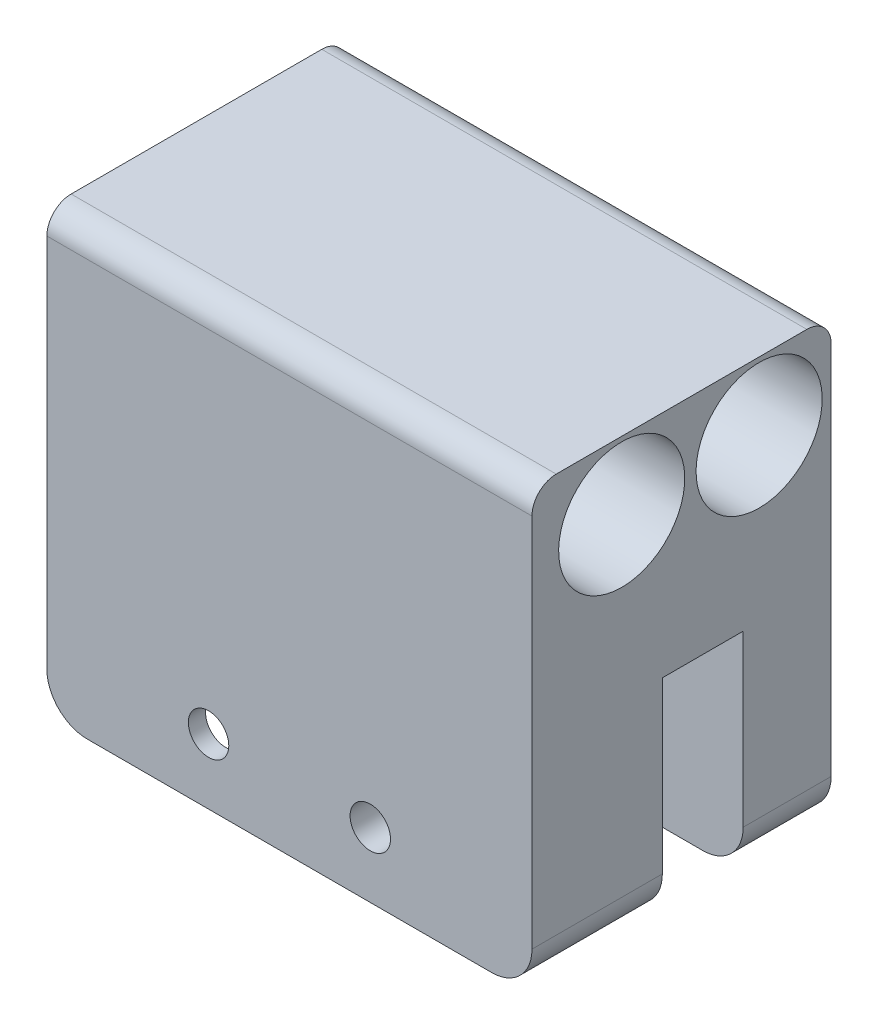
ISO-10303-21;
HEADER;
FILE_DESCRIPTION(('STEP AP214'),'2;1');
FILE_NAME('part.step','',(''),(''),'','','');
FILE_SCHEMA(('AUTOMOTIVE_DESIGN { 1 0 10303 214 1 1 1 1 }'));
ENDSEC;
DATA;
#1=APPLICATION_CONTEXT('core data for automotive mechanical design processes');
#2=APPLICATION_PROTOCOL_DEFINITION('international standard','automotive_design',2000,#1);
#3=PRODUCT_CONTEXT('',#1,'mechanical');
#4=PRODUCT('Part','Part','',(#3));
#5=PRODUCT_RELATED_PRODUCT_CATEGORY('part','',(#4));
#6=PRODUCT_DEFINITION_FORMATION('','',#4);
#7=PRODUCT_DEFINITION_CONTEXT('part definition',#1,'design');
#8=PRODUCT_DEFINITION('design','',#6,#7);
#9=PRODUCT_DEFINITION_SHAPE('','',#8);
#10=(LENGTH_UNIT() NAMED_UNIT(*) SI_UNIT(.MILLI.,.METRE.));
#11=(NAMED_UNIT(*) PLANE_ANGLE_UNIT() SI_UNIT($,.RADIAN.));
#12=(NAMED_UNIT(*) SI_UNIT($,.STERADIAN.) SOLID_ANGLE_UNIT());
#13=UNCERTAINTY_MEASURE_WITH_UNIT(LENGTH_MEASURE(1.E-05),#10,'distance_accuracy_value','');
#14=(GEOMETRIC_REPRESENTATION_CONTEXT(3) GLOBAL_UNCERTAINTY_ASSIGNED_CONTEXT((#13)) GLOBAL_UNIT_ASSIGNED_CONTEXT((#10,
#11,#12)) REPRESENTATION_CONTEXT('',''));
#15=CARTESIAN_POINT('',(0.,0.,0.));
#16=DIRECTION('',(0.,0.,1.));
#17=DIRECTION('',(1.,0.,0.));
#18=AXIS2_PLACEMENT_3D('',#15,#16,#17);
#19=CARTESIAN_POINT('',(-250.000000000002,198.300809789814,40.));
#20=DIRECTION('',(1.,0.,0.));
#21=DIRECTION('',(0.,0.,-1.));
#22=AXIS2_PLACEMENT_3D('',#19,#20,#21);
#23=PLANE('',#22);
#24=DIRECTION('',(0.,0.,1.));
#25=VECTOR('',#24,1.);
#26=CARTESIAN_POINT('',(-250.000000000002,194.212207188512,27.8748607563625));
#27=LINE('',#26,#25);
#28=CARTESIAN_POINT('',(-250.000000000002,194.212207188512,27.8748607563625));
#29=VERTEX_POINT('',#28);
#30=CARTESIAN_POINT('',(-250.000000000002,194.212207188512,37.8748607563625));
#31=VERTEX_POINT('',#30);
#32=EDGE_CURVE('E211',#29,#31,#27,.T.);
#33=ORIENTED_EDGE('',*,*,#32,.T.);
#34=DIRECTION('',(0.,-1.,0.));
#35=VECTOR('',#34,1.);
#36=CARTESIAN_POINT('',(-250.000000000002,184.212207188512,37.8748607563625));
#37=LINE('',#36,#35);
#38=CARTESIAN_POINT('',(-250.000000000002,173.212189340529,37.8748607563625));
#39=VERTEX_POINT('',#38);
#40=EDGE_CURVE('E214',#31,#39,#37,.T.);
#41=ORIENTED_EDGE('',*,*,#40,.T.);
#42=DIRECTION('',(0.,0.,-1.));
#43=VECTOR('',#42,1.);
#44=CARTESIAN_POINT('',(-250.000000000002,173.212189340529,40.));
#45=LINE('',#44,#43);
#46=CARTESIAN_POINT('',(-250.000000000002,173.212189340529,40.));
#47=VERTEX_POINT('',#46);
#48=EDGE_CURVE('E363',#47,#39,#45,.T.);
#49=ORIENTED_EDGE('',*,*,#48,.F.);
#50=DIRECTION('',(0.,1.,0.));
#51=VECTOR('',#50,1.);
#52=CARTESIAN_POINT('',(-250.000000000002,198.300809789814,40.));
#53=LINE('',#52,#51);
#54=CARTESIAN_POINT('',(-250.000000000002,219.601892068504,40.));
#55=VERTEX_POINT('',#54);
#56=EDGE_CURVE('E347',#47,#55,#53,.T.);
#57=ORIENTED_EDGE('',*,*,#56,.T.);
#58=CARTESIAN_POINT('',(-250.000000000002,219.601892068504,37.));
#59=DIRECTION('',(-1.,0.,0.));
#60=DIRECTION('',(0.,0.,-1.));
#61=AXIS2_PLACEMENT_3D('',#58,#59,#60);
#62=CIRCLE('',#61,3.);
#63=CARTESIAN_POINT('',(-250.000000000002,222.601892068504,37.));
#64=VERTEX_POINT('',#63);
#65=EDGE_CURVE('E378',#64,#55,#62,.F.);
#66=ORIENTED_EDGE('',*,*,#65,.F.);
#67=DIRECTION('',(0.,0.,-1.));
#68=VECTOR('',#67,1.);
#69=CARTESIAN_POINT('',(-250.000000000002,222.601892068504,40.));
#70=LINE('',#69,#68);
#71=CARTESIAN_POINT('',(-250.000000000002,222.601892068504,6.00000000000001));
#72=VERTEX_POINT('',#71);
#73=EDGE_CURVE('E359',#64,#72,#70,.T.);
#74=ORIENTED_EDGE('',*,*,#73,.T.);
#75=CARTESIAN_POINT('',(-250.000000000002,219.601892068504,6.));
#76=DIRECTION('',(-1.,0.,0.));
#77=DIRECTION('',(0.,0.,-1.));
#78=AXIS2_PLACEMENT_3D('',#75,#76,#77);
#79=CIRCLE('',#78,3.);
#80=CARTESIAN_POINT('',(-250.000000000002,219.601892068504,3.));
#81=VERTEX_POINT('',#80);
#82=EDGE_CURVE('E381',#81,#72,#79,.F.);
#83=ORIENTED_EDGE('',*,*,#82,.F.);
#84=DIRECTION('',(0.,-1.,0.));
#85=VECTOR('',#84,1.);
#86=CARTESIAN_POINT('',(-250.000000000002,222.601892068504,3.));
#87=LINE('',#86,#85);
#88=CARTESIAN_POINT('',(-250.000000000002,173.212189340529,3.));
#89=VERTEX_POINT('',#88);
#90=EDGE_CURVE('E320',#81,#89,#87,.T.);
#91=ORIENTED_EDGE('',*,*,#90,.T.);
#92=CARTESIAN_POINT('',(-250.000000000002,173.212189340529,13.8748607563626));
#93=VERTEX_POINT('',#92);
#94=EDGE_CURVE('E362',#93,#89,#45,.T.);
#95=ORIENTED_EDGE('',*,*,#94,.F.);
#96=DIRECTION('',(0.,1.,0.));
#97=VECTOR('',#96,1.);
#98=CARTESIAN_POINT('',(-250.000000000002,194.212207188512,13.8748607563625));
#99=LINE('',#98,#97);
#100=CARTESIAN_POINT('',(-250.000000000002,194.212207188512,13.8748607563625));
#101=VERTEX_POINT('',#100);
#102=EDGE_CURVE('E287',#93,#101,#99,.T.);
#103=ORIENTED_EDGE('',*,*,#102,.T.);
#104=DIRECTION('',(0.,0.,1.));
#105=VECTOR('',#104,1.);
#106=CARTESIAN_POINT('',(-250.000000000002,194.212207188512,13.8748607563625));
#107=LINE('',#106,#105);
#108=CARTESIAN_POINT('',(-250.000000000002,194.212207188512,23.8748607563625));
#109=VERTEX_POINT('',#108);
#110=EDGE_CURVE('E282',#101,#109,#107,.T.);
#111=ORIENTED_EDGE('',*,*,#110,.T.);
#112=DIRECTION('',(0.,-1.,0.));
#113=VECTOR('',#112,1.);
#114=CARTESIAN_POINT('',(-250.000000000002,184.212207188512,23.8748607563625));
#115=LINE('',#114,#113);
#116=CARTESIAN_POINT('',(-250.000000000002,173.212189340529,23.8748607563625));
#117=VERTEX_POINT('',#116);
#118=EDGE_CURVE('E292',#109,#117,#115,.T.);
#119=ORIENTED_EDGE('',*,*,#118,.T.);
#120=CARTESIAN_POINT('',(-250.000000000002,173.212189340529,27.8748607563626));
#121=VERTEX_POINT('',#120);
#122=EDGE_CURVE('E367',#121,#117,#45,.T.);
#123=ORIENTED_EDGE('',*,*,#122,.F.);
#124=DIRECTION('',(0.,1.,0.));
#125=VECTOR('',#124,1.);
#126=CARTESIAN_POINT('',(-250.000000000002,184.212207188512,27.8748607563625));
#127=LINE('',#126,#125);
#128=EDGE_CURVE('E224',#121,#29,#127,.T.);
#129=ORIENTED_EDGE('',*,*,#128,.T.);
#130=EDGE_LOOP('',(#33,#41,#49,#57,#66,#74,#83,#91,#95,#103,#111,#119,#123,#129));
#131=FACE_BOUND('',#130,.T.);
#132=CARTESIAN_POINT('',(-250.000000000002,214.212207188512,11.9024120802236));
#133=DIRECTION('',(-1.,0.,0.));
#134=DIRECTION('',(0.,-1.,0.));
#135=AXIS2_PLACEMENT_3D('',#132,#133,#134);
#136=CIRCLE('',#135,7.79999999999996);
#137=CARTESIAN_POINT('',(-250.000000000002,206.412207188512,11.9024120802236));
#138=VERTEX_POINT('',#137);
#139=EDGE_CURVE('E327',#138,#138,#136,.T.);
#140=ORIENTED_EDGE('',*,*,#139,.F.);
#141=EDGE_LOOP('',(#140));
#142=FACE_BOUND('',#141,.T.);
#143=CARTESIAN_POINT('',(-250.000000000002,214.212207188512,28.9024120802236));
#144=DIRECTION('',(-1.,0.,0.));
#145=DIRECTION('',(0.,-1.,0.));
#146=AXIS2_PLACEMENT_3D('',#143,#144,#145);
#147=CIRCLE('',#146,7.79999999999994);
#148=CARTESIAN_POINT('',(-250.000000000002,206.412207188512,28.9024120802236));
#149=VERTEX_POINT('',#148);
#150=EDGE_CURVE('E334',#149,#149,#147,.T.);
#151=ORIENTED_EDGE('',*,*,#150,.F.);
#152=EDGE_LOOP('',(#151));
#153=FACE_BOUND('',#152,.T.);
#154=DIRECTION('',(0.,-1.,0.));
#155=VECTOR('',#154,1.);
#156=CARTESIAN_POINT('',(-250.000000000002,200.712207188564,15.7200000000164));
#157=LINE('',#156,#155);
#158=CARTESIAN_POINT('',(-250.000000000002,205.712207188564,15.7200000000164));
#159=VERTEX_POINT('',#158);
#160=CARTESIAN_POINT('',(-250.000000000002,200.712207188564,15.7200000000164));
#161=VERTEX_POINT('',#160);
#162=EDGE_CURVE('E210',#159,#161,#157,.T.);
#163=ORIENTED_EDGE('',*,*,#162,.F.);
#164=DIRECTION('',(0.,0.,-1.));
#165=VECTOR('',#164,1.);
#166=CARTESIAN_POINT('',(-250.000000000002,205.712207188564,15.7200000000164));
#167=LINE('',#166,#165);
#168=CARTESIAN_POINT('',(-250.000000000002,205.712207188564,17.7200000000164));
#169=VERTEX_POINT('',#168);
#170=EDGE_CURVE('E207',#169,#159,#167,.T.);
#171=ORIENTED_EDGE('',*,*,#170,.F.);
#172=DIRECTION('',(0.,1.,0.));
#173=VECTOR('',#172,1.);
#174=CARTESIAN_POINT('',(-250.000000000002,200.712207188564,17.7200000000164));
#175=LINE('',#174,#173);
#176=CARTESIAN_POINT('',(-250.000000000002,200.712207188564,17.7200000000164));
#177=VERTEX_POINT('',#176);
#178=EDGE_CURVE('E55',#177,#169,#175,.T.);
#179=ORIENTED_EDGE('',*,*,#178,.F.);
#180=DIRECTION('',(0.,0.,1.));
#181=VECTOR('',#180,1.);
#182=CARTESIAN_POINT('',(-250.000000000002,200.712207188564,15.7200000000164));
#183=LINE('',#182,#181);
#184=EDGE_CURVE('E50',#161,#177,#183,.T.);
#185=ORIENTED_EDGE('',*,*,#184,.F.);
#186=EDGE_LOOP('',(#163,#171,#179,#185));
#187=FACE_BOUND('',#186,.T.);
#188=ADVANCED_FACE('F35',(#131,#142,#153,#187),#23,.F.);
#189=CARTESIAN_POINT('',(-245.000000000002,173.212189340529,40.));
#190=DIRECTION('',(0.,0.,-1.));
#191=DIRECTION('',(-1.,0.,0.));
#192=AXIS2_PLACEMENT_3D('',#189,#190,#191);
#193=CYLINDRICAL_SURFACE('',#192,5.);
#194=ORIENTED_EDGE('',*,*,#122,.T.);
#195=CARTESIAN_POINT('',(-245.000000000002,173.212189340529,23.8748607563625));
#196=DIRECTION('',(0.,0.,-1.));
#197=DIRECTION('',(1.,0.,0.));
#198=AXIS2_PLACEMENT_3D('',#195,#196,#197);
#199=CIRCLE('',#198,5.);
#200=CARTESIAN_POINT('',(-245.000000000002,168.212189340529,23.8748607563625));
#201=VERTEX_POINT('',#200);
#202=EDGE_CURVE('E298',#201,#117,#199,.T.);
#203=ORIENTED_EDGE('',*,*,#202,.F.);
#204=DIRECTION('',(0.,0.,-1.));
#205=VECTOR('',#204,1.);
#206=CARTESIAN_POINT('',(-245.000000000002,168.212189340529,40.));
#207=LINE('',#206,#205);
#208=CARTESIAN_POINT('',(-245.000000000002,168.212189340529,27.8748607563626));
#209=VERTEX_POINT('',#208);
#210=EDGE_CURVE('E372',#209,#201,#207,.T.);
#211=ORIENTED_EDGE('',*,*,#210,.F.);
#212=CARTESIAN_POINT('',(-245.000000000002,173.212189340529,27.8748607563626));
#213=DIRECTION('',(0.,0.,1.));
#214=DIRECTION('',(0.,-1.,0.));
#215=AXIS2_PLACEMENT_3D('',#212,#213,#214);
#216=CIRCLE('',#215,5.);
#217=EDGE_CURVE('E244',#121,#209,#216,.T.);
#218=ORIENTED_EDGE('',*,*,#217,.F.);
#219=EDGE_LOOP('',(#194,#203,#211,#218));
#220=FACE_BOUND('',#219,.T.);
#221=ADVANCED_FACE('F413',(#220),#193,.T.);
#222=CARTESIAN_POINT('',(-230.000000000002,176.251270746749,3.));
#223=DIRECTION('',(0.,0.,1.));
#224=DIRECTION('',(1.,0.,0.));
#225=AXIS2_PLACEMENT_3D('',#222,#223,#224);
#226=CYLINDRICAL_SURFACE('',#225,2.5);
#227=CARTESIAN_POINT('',(-230.000000000002,176.251270746749,27.8748607563625));
#228=DIRECTION('',(0.,0.,1.));
#229=DIRECTION('',(0.,-1.,0.));
#230=AXIS2_PLACEMENT_3D('',#227,#228,#229);
#231=CIRCLE('',#230,2.5);
#232=CARTESIAN_POINT('',(-230.000000000002,173.751270746749,27.8748607563626));
#233=VERTEX_POINT('',#232);
#234=EDGE_CURVE('E243',#233,#233,#231,.F.);
#235=ORIENTED_EDGE('',*,*,#234,.F.);
#236=EDGE_LOOP('',(#235));
#237=FACE_BOUND('',#236,.T.);
#238=CARTESIAN_POINT('',(-230.000000000002,176.251270746749,23.8748607563625));
#239=DIRECTION('',(0.,0.,-1.));
#240=DIRECTION('',(1.,0.,0.));
#241=AXIS2_PLACEMENT_3D('',#238,#239,#240);
#242=CIRCLE('',#241,2.5);
#243=CARTESIAN_POINT('',(-227.500000000002,176.251270746749,23.8748607563625));
#244=VERTEX_POINT('',#243);
#245=EDGE_CURVE('E266',#244,#244,#242,.T.);
#246=ORIENTED_EDGE('',*,*,#245,.T.);
#247=EDGE_LOOP('',(#246));
#248=FACE_BOUND('',#247,.T.);
#249=ADVANCED_FACE('F409',(#237,#248),#226,.F.);
#250=CARTESIAN_POINT('',(-195.000000000002,173.212189340529,40.));
#251=DIRECTION('',(0.,0.,-1.));
#252=DIRECTION('',(-1.,0.,0.));
#253=AXIS2_PLACEMENT_3D('',#250,#251,#252);
#254=CYLINDRICAL_SURFACE('',#253,5.);
#255=DIRECTION('',(0.,0.,-1.));
#256=VECTOR('',#255,1.);
#257=CARTESIAN_POINT('',(-195.000000000002,168.212189340529,40.));
#258=LINE('',#257,#256);
#259=CARTESIAN_POINT('',(-195.000000000002,168.212189340529,13.8748607563626));
#260=VERTEX_POINT('',#259);
#261=CARTESIAN_POINT('',(-195.000000000002,168.212189340529,3.));
#262=VERTEX_POINT('',#261);
#263=EDGE_CURVE('E371',#260,#262,#258,.T.);
#264=ORIENTED_EDGE('',*,*,#263,.T.);
#265=CARTESIAN_POINT('',(-195.000000000002,173.212189340529,3.));
#266=DIRECTION('',(0.,0.,1.));
#267=DIRECTION('',(-1.,0.,0.));
#268=AXIS2_PLACEMENT_3D('',#265,#266,#267);
#269=CIRCLE('',#268,5.);
#270=CARTESIAN_POINT('',(-190.000000000002,173.212189340529,3.00000000000002));
#271=VERTEX_POINT('',#270);
#272=EDGE_CURVE('E314',#262,#271,#269,.T.);
#273=ORIENTED_EDGE('',*,*,#272,.T.);
#274=DIRECTION('',(0.,0.,-1.));
#275=VECTOR('',#274,1.);
#276=CARTESIAN_POINT('',(-190.000000000002,173.212189340529,40.));
#277=LINE('',#276,#275);
#278=CARTESIAN_POINT('',(-190.000000000002,173.212189340529,13.8748607563625));
#279=VERTEX_POINT('',#278);
#280=EDGE_CURVE('E352',#279,#271,#277,.T.);
#281=ORIENTED_EDGE('',*,*,#280,.F.);
#282=CARTESIAN_POINT('',(-195.000000000002,173.212189340529,13.8748607563626));
#283=DIRECTION('',(0.,0.,1.));
#284=DIRECTION('',(0.,-1.,0.));
#285=AXIS2_PLACEMENT_3D('',#282,#283,#284);
#286=CIRCLE('',#285,5.);
#287=EDGE_CURVE('E311',#260,#279,#286,.T.);
#288=ORIENTED_EDGE('',*,*,#287,.F.);
#289=EDGE_LOOP('',(#264,#273,#281,#288));
#290=FACE_BOUND('',#289,.T.);
#291=ADVANCED_FACE('F412',(#290),#254,.T.);
#292=CARTESIAN_POINT('',(-245.000000000002,168.212189340529,40.));
#293=DIRECTION('',(0.,1.,0.));
#294=DIRECTION('',(0.,0.,-1.));
#295=AXIS2_PLACEMENT_3D('',#292,#293,#294);
#296=PLANE('',#295);
#297=CARTESIAN_POINT('',(-199.500000000002,168.212189340529,8.5));
#298=DIRECTION('',(0.,1.,0.));
#299=DIRECTION('',(0.,0.,1.));
#300=AXIS2_PLACEMENT_3D('',#297,#298,#299);
#301=CIRCLE('',#300,4.25000000000001);
#302=CARTESIAN_POINT('',(-199.500000000002,168.212189340529,12.75));
#303=VERTEX_POINT('',#302);
#304=EDGE_CURVE('E255',#303,#303,#301,.T.);
#305=ORIENTED_EDGE('',*,*,#304,.T.);
#306=EDGE_LOOP('',(#305));
#307=FACE_BOUND('',#306,.T.);
#308=CARTESIAN_POINT('',(-240.500000000002,168.212189340529,8.50000000000003));
#309=DIRECTION('',(0.,1.,0.));
#310=DIRECTION('',(0.,0.,-1.));
#311=AXIS2_PLACEMENT_3D('',#308,#309,#310);
#312=CIRCLE('',#311,4.25);
#313=CARTESIAN_POINT('',(-240.500000000002,168.212189340529,4.25000000000003));
#314=VERTEX_POINT('',#313);
#315=EDGE_CURVE('E250',#314,#314,#312,.T.);
#316=ORIENTED_EDGE('',*,*,#315,.T.);
#317=EDGE_LOOP('',(#316));
#318=FACE_BOUND('',#317,.T.);
#319=CARTESIAN_POINT('',(-245.000000000002,168.212189340529,13.8748607563626));
#320=VERTEX_POINT('',#319);
#321=CARTESIAN_POINT('',(-245.000000000002,168.212189340529,3.));
#322=VERTEX_POINT('',#321);
#323=EDGE_CURVE('E366',#320,#322,#207,.T.);
#324=ORIENTED_EDGE('',*,*,#323,.T.);
#325=DIRECTION('',(1.,0.,0.));
#326=VECTOR('',#325,1.);
#327=CARTESIAN_POINT('',(-245.000000000002,168.212189340529,3.));
#328=LINE('',#327,#326);
#329=EDGE_CURVE('E324',#322,#262,#328,.T.);
#330=ORIENTED_EDGE('',*,*,#329,.T.);
#331=ORIENTED_EDGE('',*,*,#263,.F.);
#332=DIRECTION('',(1.,0.,0.));
#333=VECTOR('',#332,1.);
#334=CARTESIAN_POINT('',(-245.000000000002,168.212189340529,13.8748607563626));
#335=LINE('',#334,#333);
#336=EDGE_CURVE('E309',#320,#260,#335,.T.);
#337=ORIENTED_EDGE('',*,*,#336,.F.);
#338=EDGE_LOOP('',(#324,#330,#331,#337));
#339=FACE_BOUND('',#338,.T.);
#340=ADVANCED_FACE('F473',(#307,#318,#339),#296,.F.);
#341=ORIENTED_EDGE('',*,*,#94,.T.);
#342=CARTESIAN_POINT('',(-245.000000000002,173.212189340529,3.));
#343=DIRECTION('',(0.,0.,1.));
#344=DIRECTION('',(-1.,0.,0.));
#345=AXIS2_PLACEMENT_3D('',#342,#343,#344);
#346=CIRCLE('',#345,5.);
#347=EDGE_CURVE('E322',#89,#322,#346,.T.);
#348=ORIENTED_EDGE('',*,*,#347,.T.);
#349=ORIENTED_EDGE('',*,*,#323,.F.);
#350=CARTESIAN_POINT('',(-245.000000000002,173.212189340529,13.8748607563626));
#351=DIRECTION('',(0.,0.,1.));
#352=DIRECTION('',(0.,-1.,0.));
#353=AXIS2_PLACEMENT_3D('',#350,#351,#352);
#354=CIRCLE('',#353,5.);
#355=EDGE_CURVE('E307',#93,#320,#354,.T.);
#356=ORIENTED_EDGE('',*,*,#355,.F.);
#357=EDGE_LOOP('',(#341,#348,#349,#356));
#358=FACE_BOUND('',#357,.T.);
#359=ADVANCED_FACE('F458',(#358),#193,.T.);
#360=CARTESIAN_POINT('',(-190.000000000002,173.212189340529,40.));
#361=VERTEX_POINT('',#360);
#362=CARTESIAN_POINT('',(-190.000000000002,173.212189340529,23.8748607563625));
#363=VERTEX_POINT('',#362);
#364=EDGE_CURVE('E353',#361,#363,#277,.T.);
#365=ORIENTED_EDGE('',*,*,#364,.F.);
#366=CARTESIAN_POINT('',(-195.000000000002,173.212189340529,40.));
#367=DIRECTION('',(0.,0.,-1.));
#368=DIRECTION('',(-1.,0.,0.));
#369=AXIS2_PLACEMENT_3D('',#366,#367,#368);
#370=CIRCLE('',#369,5.);
#371=CARTESIAN_POINT('',(-195.000000000002,168.212189340529,40.));
#372=VERTEX_POINT('',#371);
#373=EDGE_CURVE('E330',#361,#372,#370,.T.);
#374=ORIENTED_EDGE('',*,*,#373,.T.);
#375=CARTESIAN_POINT('',(-195.000000000002,168.212189340529,23.8748607563625));
#376=VERTEX_POINT('',#375);
#377=EDGE_CURVE('E373',#372,#376,#258,.T.);
#378=ORIENTED_EDGE('',*,*,#377,.T.);
#379=CARTESIAN_POINT('',(-195.000000000002,173.212189340529,23.8748607563625));
#380=DIRECTION('',(0.,0.,-1.));
#381=DIRECTION('',(1.,0.,0.));
#382=AXIS2_PLACEMENT_3D('',#379,#380,#381);
#383=CIRCLE('',#382,5.);
#384=EDGE_CURVE('E304',#363,#376,#383,.T.);
#385=ORIENTED_EDGE('',*,*,#384,.F.);
#386=EDGE_LOOP('',(#365,#374,#378,#385));
#387=FACE_BOUND('',#386,.T.);
#388=ADVANCED_FACE('F433',(#387),#254,.T.);
#389=ORIENTED_EDGE('',*,*,#210,.T.);
#390=DIRECTION('',(-1.,0.,0.));
#391=VECTOR('',#390,1.);
#392=CARTESIAN_POINT('',(-245.000000000002,168.212189340529,23.8748607563625));
#393=LINE('',#392,#391);
#394=EDGE_CURVE('E302',#376,#201,#393,.T.);
#395=ORIENTED_EDGE('',*,*,#394,.F.);
#396=ORIENTED_EDGE('',*,*,#377,.F.);
#397=DIRECTION('',(-1.,0.,0.));
#398=VECTOR('',#397,1.);
#399=CARTESIAN_POINT('',(-245.000000000002,168.212189340529,40.));
#400=LINE('',#399,#398);
#401=CARTESIAN_POINT('',(-245.000000000002,168.212189340529,40.));
#402=VERTEX_POINT('',#401);
#403=EDGE_CURVE('E341',#372,#402,#400,.T.);
#404=ORIENTED_EDGE('',*,*,#403,.T.);
#405=CARTESIAN_POINT('',(-245.000000000002,168.212189340529,37.8748607563625));
#406=VERTEX_POINT('',#405);
#407=EDGE_CURVE('E368',#402,#406,#207,.T.);
#408=ORIENTED_EDGE('',*,*,#407,.T.);
#409=DIRECTION('',(-1.,0.,0.));
#410=VECTOR('',#409,1.);
#411=CARTESIAN_POINT('',(-245.000000000002,168.212189340529,37.8748607563625));
#412=LINE('',#411,#410);
#413=CARTESIAN_POINT('',(-220.000000000002,168.212189340529,37.8748607563626));
#414=VERTEX_POINT('',#413);
#415=EDGE_CURVE('E240',#414,#406,#412,.T.);
#416=ORIENTED_EDGE('',*,*,#415,.F.);
#417=DIRECTION('',(0.,0.,-1.));
#418=VECTOR('',#417,1.);
#419=CARTESIAN_POINT('',(-220.000000000002,168.212189340529,40.));
#420=LINE('',#419,#418);
#421=CARTESIAN_POINT('',(-220.000000000002,168.212189340529,27.8748607563625));
#422=VERTEX_POINT('',#421);
#423=EDGE_CURVE('E11',#414,#422,#420,.T.);
#424=ORIENTED_EDGE('',*,*,#423,.T.);
#425=DIRECTION('',(1.,0.,0.));
#426=VECTOR('',#425,1.);
#427=CARTESIAN_POINT('',(-245.000000000002,168.212189340529,27.8748607563626));
#428=LINE('',#427,#426);
#429=EDGE_CURVE('E247',#209,#422,#428,.T.);
#430=ORIENTED_EDGE('',*,*,#429,.F.);
#431=EDGE_LOOP('',(#389,#395,#396,#404,#408,#416,#424,#430));
#432=FACE_BOUND('',#431,.T.);
#433=ADVANCED_FACE('F446',(#432),#296,.F.);
#434=ORIENTED_EDGE('',*,*,#407,.F.);
#435=CARTESIAN_POINT('',(-245.000000000002,173.212189340529,40.));
#436=DIRECTION('',(0.,0.,-1.));
#437=DIRECTION('',(-1.,0.,0.));
#438=AXIS2_PLACEMENT_3D('',#435,#436,#437);
#439=CIRCLE('',#438,5.);
#440=EDGE_CURVE('E344',#402,#47,#439,.T.);
#441=ORIENTED_EDGE('',*,*,#440,.T.);
#442=ORIENTED_EDGE('',*,*,#48,.T.);
#443=CARTESIAN_POINT('',(-245.000000000002,173.212189340529,37.8748607563625));
#444=DIRECTION('',(0.,0.,-1.));
#445=DIRECTION('',(1.,0.,0.));
#446=AXIS2_PLACEMENT_3D('',#443,#444,#445);
#447=CIRCLE('',#446,5.);
#448=EDGE_CURVE('E237',#406,#39,#447,.T.);
#449=ORIENTED_EDGE('',*,*,#448,.F.);
#450=EDGE_LOOP('',(#434,#441,#442,#449));
#451=FACE_BOUND('',#450,.T.);
#452=ADVANCED_FACE('F496',(#451),#193,.T.);
#453=CARTESIAN_POINT('',(-194.03319899616,222.601892068504,40.));
#454=DIRECTION('',(0.,-1.,0.));
#455=DIRECTION('',(0.,0.,1.));
#456=AXIS2_PLACEMENT_3D('',#453,#454,#455);
#457=PLANE('',#456);
#458=ORIENTED_EDGE('',*,*,#73,.F.);
#459=DIRECTION('',(1.,0.,0.));
#460=VECTOR('',#459,1.);
#461=CARTESIAN_POINT('',(-194.03319899616,222.601892068504,37.));
#462=LINE('',#461,#460);
#463=CARTESIAN_POINT('',(-190.000000000002,222.601892068504,37.));
#464=VERTEX_POINT('',#463);
#465=EDGE_CURVE('E384',#464,#64,#462,.F.);
#466=ORIENTED_EDGE('',*,*,#465,.F.);
#467=DIRECTION('',(0.,0.,-1.));
#468=VECTOR('',#467,1.);
#469=CARTESIAN_POINT('',(-190.000000000002,222.601892068504,40.));
#470=LINE('',#469,#468);
#471=CARTESIAN_POINT('',(-190.000000000002,222.601892068504,6.00000000000001));
#472=VERTEX_POINT('',#471);
#473=EDGE_CURVE('E356',#464,#472,#470,.T.);
#474=ORIENTED_EDGE('',*,*,#473,.T.);
#475=DIRECTION('',(-1.,0.,0.));
#476=VECTOR('',#475,1.);
#477=CARTESIAN_POINT('',(-190.000000000002,222.601892068504,6.));
#478=LINE('',#477,#476);
#479=EDGE_CURVE('E386',#72,#472,#478,.F.);
#480=ORIENTED_EDGE('',*,*,#479,.F.);
#481=EDGE_LOOP('',(#458,#466,#474,#480));
#482=FACE_BOUND('',#481,.T.);
#483=ADVANCED_FACE('F498',(#482),#457,.F.);
#484=CARTESIAN_POINT('',(-190.000000000002,173.212189340529,40.));
#485=DIRECTION('',(-1.,0.,0.));
#486=DIRECTION('',(0.,1.,0.));
#487=AXIS2_PLACEMENT_3D('',#484,#485,#486);
#488=PLANE('',#487);
#489=CARTESIAN_POINT('',(-190.000000000002,214.212207188512,28.9024120802236));
#490=DIRECTION('',(-1.,0.,0.));
#491=DIRECTION('',(0.,-1.,0.));
#492=AXIS2_PLACEMENT_3D('',#489,#490,#491);
#493=CIRCLE('',#492,7.79999999999994);
#494=CARTESIAN_POINT('',(-190.000000000002,206.412207188512,28.9024120802236));
#495=VERTEX_POINT('',#494);
#496=EDGE_CURVE('E326',#495,#495,#493,.T.);
#497=ORIENTED_EDGE('',*,*,#496,.T.);
#498=EDGE_LOOP('',(#497));
#499=FACE_BOUND('',#498,.T.);
#500=CARTESIAN_POINT('',(-190.000000000002,214.212207188512,11.9024120802236));
#501=DIRECTION('',(-1.,0.,0.));
#502=DIRECTION('',(0.,-1.,0.));
#503=AXIS2_PLACEMENT_3D('',#500,#501,#502);
#504=CIRCLE('',#503,7.79999999999996);
#505=CARTESIAN_POINT('',(-190.000000000002,206.412207188512,11.9024120802236));
#506=VERTEX_POINT('',#505);
#507=EDGE_CURVE('E331',#506,#506,#504,.T.);
#508=ORIENTED_EDGE('',*,*,#507,.T.);
#509=EDGE_LOOP('',(#508));
#510=FACE_BOUND('',#509,.T.);
#511=ORIENTED_EDGE('',*,*,#280,.T.);
#512=DIRECTION('',(0.,1.,0.));
#513=VECTOR('',#512,1.);
#514=CARTESIAN_POINT('',(-190.000000000002,173.212189340529,3.));
#515=LINE('',#514,#513);
#516=CARTESIAN_POINT('',(-190.000000000002,219.601892068504,3.));
#517=VERTEX_POINT('',#516);
#518=EDGE_CURVE('E317',#271,#517,#515,.T.);
#519=ORIENTED_EDGE('',*,*,#518,.T.);
#520=CARTESIAN_POINT('',(-190.000000000002,219.601892068504,6.));
#521=DIRECTION('',(1.,0.,0.));
#522=DIRECTION('',(0.,1.,0.));
#523=AXIS2_PLACEMENT_3D('',#520,#521,#522);
#524=CIRCLE('',#523,3.);
#525=EDGE_CURVE('E391',#472,#517,#524,.F.);
#526=ORIENTED_EDGE('',*,*,#525,.F.);
#527=ORIENTED_EDGE('',*,*,#473,.F.);
#528=CARTESIAN_POINT('',(-190.000000000002,219.601892068504,37.));
#529=DIRECTION('',(1.,0.,0.));
#530=DIRECTION('',(0.,1.,0.));
#531=AXIS2_PLACEMENT_3D('',#528,#529,#530);
#532=CIRCLE('',#531,3.);
#533=CARTESIAN_POINT('',(-190.000000000002,219.601892068504,40.));
#534=VERTEX_POINT('',#533);
#535=EDGE_CURVE('E389',#534,#464,#532,.F.);
#536=ORIENTED_EDGE('',*,*,#535,.F.);
#537=DIRECTION('',(0.,-1.,0.));
#538=VECTOR('',#537,1.);
#539=CARTESIAN_POINT('',(-190.000000000002,222.601892068504,40.));
#540=LINE('',#539,#538);
#541=EDGE_CURVE('E350',#534,#361,#540,.T.);
#542=ORIENTED_EDGE('',*,*,#541,.T.);
#543=ORIENTED_EDGE('',*,*,#364,.T.);
#544=DIRECTION('',(0.,-1.,0.));
#545=VECTOR('',#544,1.);
#546=CARTESIAN_POINT('',(-190.000000000002,194.212207188512,23.8748607563625));
#547=LINE('',#546,#545);
#548=CARTESIAN_POINT('',(-190.000000000002,194.212207188512,23.8748607563625));
#549=VERTEX_POINT('',#548);
#550=EDGE_CURVE('E286',#549,#363,#547,.T.);
#551=ORIENTED_EDGE('',*,*,#550,.F.);
#552=DIRECTION('',(0.,0.,1.));
#553=VECTOR('',#552,1.);
#554=CARTESIAN_POINT('',(-190.000000000002,194.212207188512,13.8748607563625));
#555=LINE('',#554,#553);
#556=CARTESIAN_POINT('',(-190.000000000002,194.212207188512,13.8748607563625));
#557=VERTEX_POINT('',#556);
#558=EDGE_CURVE('E283',#557,#549,#555,.T.);
#559=ORIENTED_EDGE('',*,*,#558,.F.);
#560=DIRECTION('',(0.,1.,0.));
#561=VECTOR('',#560,1.);
#562=CARTESIAN_POINT('',(-190.000000000002,173.212189340529,13.8748607563626));
#563=LINE('',#562,#561);
#564=EDGE_CURVE('E43',#279,#557,#563,.T.);
#565=ORIENTED_EDGE('',*,*,#564,.F.);
#566=EDGE_LOOP('',(#511,#519,#526,#527,#536,#542,#543,#551,#559,#565));
#567=FACE_BOUND('',#566,.T.);
#568=ADVANCED_FACE('F436',(#499,#510,#567),#488,.F.);
#569=CARTESIAN_POINT('',(-195.000000000002,173.212189340529,40.));
#570=DIRECTION('',(0.,0.,-1.));
#571=DIRECTION('',(-1.,0.,0.));
#572=AXIS2_PLACEMENT_3D('',#569,#570,#571);
#573=PLANE('',#572);
#574=CARTESIAN_POINT('',(-210.000000000002,176.251270746749,40.));
#575=DIRECTION('',(0.,0.,-1.));
#576=DIRECTION('',(1.,0.,0.));
#577=AXIS2_PLACEMENT_3D('',#574,#575,#576);
#578=CIRCLE('',#577,2.5);
#579=CARTESIAN_POINT('',(-207.500000000002,176.251270746749,40.));
#580=VERTEX_POINT('',#579);
#581=EDGE_CURVE('E267',#580,#580,#578,.T.);
#582=ORIENTED_EDGE('',*,*,#581,.T.);
#583=EDGE_LOOP('',(#582));
#584=FACE_BOUND('',#583,.T.);
#585=CARTESIAN_POINT('',(-230.000000000002,176.251270746749,40.));
#586=DIRECTION('',(0.,0.,-1.));
#587=DIRECTION('',(1.,0.,0.));
#588=AXIS2_PLACEMENT_3D('',#585,#586,#587);
#589=CIRCLE('',#588,2.5);
#590=CARTESIAN_POINT('',(-227.500000000002,176.251270746749,40.));
#591=VERTEX_POINT('',#590);
#592=EDGE_CURVE('E254',#591,#591,#589,.T.);
#593=ORIENTED_EDGE('',*,*,#592,.T.);
#594=EDGE_LOOP('',(#593));
#595=FACE_BOUND('',#594,.T.);
#596=ORIENTED_EDGE('',*,*,#56,.F.);
#597=ORIENTED_EDGE('',*,*,#440,.F.);
#598=ORIENTED_EDGE('',*,*,#403,.F.);
#599=ORIENTED_EDGE('',*,*,#373,.F.);
#600=ORIENTED_EDGE('',*,*,#541,.F.);
#601=DIRECTION('',(1.,0.,0.));
#602=VECTOR('',#601,1.);
#603=CARTESIAN_POINT('',(-195.000000000002,219.601892068504,40.));
#604=LINE('',#603,#602);
#605=EDGE_CURVE('E394',#55,#534,#604,.T.);
#606=ORIENTED_EDGE('',*,*,#605,.F.);
#607=EDGE_LOOP('',(#596,#597,#598,#599,#600,#606));
#608=FACE_BOUND('',#607,.T.);
#609=ADVANCED_FACE('F442',(#584,#595,#608),#573,.F.);
#610=CARTESIAN_POINT('',(-250.000000000002,214.212207188512,28.9024120802236));
#611=DIRECTION('',(1.,0.,0.));
#612=DIRECTION('',(0.,-1.,0.));
#613=AXIS2_PLACEMENT_3D('',#610,#611,#612);
#614=CYLINDRICAL_SURFACE('',#613,7.79999999999994);
#615=ORIENTED_EDGE('',*,*,#150,.T.);
#616=EDGE_LOOP('',(#615));
#617=FACE_BOUND('',#616,.T.);
#618=ORIENTED_EDGE('',*,*,#496,.F.);
#619=EDGE_LOOP('',(#618));
#620=FACE_BOUND('',#619,.T.);
#621=ADVANCED_FACE('F735',(#617,#620),#614,.F.);
#622=CARTESIAN_POINT('',(-250.000000000002,214.212207188512,11.9024120802236));
#623=DIRECTION('',(1.,0.,0.));
#624=DIRECTION('',(0.,-1.,0.));
#625=AXIS2_PLACEMENT_3D('',#622,#623,#624);
#626=CYLINDRICAL_SURFACE('',#625,7.79999999999996);
#627=ORIENTED_EDGE('',*,*,#139,.T.);
#628=EDGE_LOOP('',(#627));
#629=FACE_BOUND('',#628,.T.);
#630=ORIENTED_EDGE('',*,*,#507,.F.);
#631=EDGE_LOOP('',(#630));
#632=FACE_BOUND('',#631,.T.);
#633=ADVANCED_FACE('F514',(#629,#632),#626,.F.);
#634=CARTESIAN_POINT('',(-195.000000000002,173.212189340529,3.));
#635=DIRECTION('',(0.,0.,-1.));
#636=DIRECTION('',(-1.,0.,0.));
#637=AXIS2_PLACEMENT_3D('',#634,#635,#636);
#638=PLANE('',#637);
#639=CARTESIAN_POINT('',(-210.000000000002,176.251270746749,3.));
#640=DIRECTION('',(0.,0.,-1.));
#641=DIRECTION('',(1.,0.,0.));
#642=AXIS2_PLACEMENT_3D('',#639,#640,#641);
#643=CIRCLE('',#642,2.5);
#644=CARTESIAN_POINT('',(-207.500000000002,176.251270746749,3.));
#645=VERTEX_POINT('',#644);
#646=EDGE_CURVE('E263',#645,#645,#643,.T.);
#647=ORIENTED_EDGE('',*,*,#646,.F.);
#648=EDGE_LOOP('',(#647));
#649=FACE_BOUND('',#648,.T.);
#650=CARTESIAN_POINT('',(-230.000000000002,176.251270746749,3.));
#651=DIRECTION('',(0.,0.,-1.));
#652=DIRECTION('',(1.,0.,0.));
#653=AXIS2_PLACEMENT_3D('',#650,#651,#652);
#654=CIRCLE('',#653,2.5);
#655=CARTESIAN_POINT('',(-227.500000000002,176.251270746749,3.));
#656=VERTEX_POINT('',#655);
#657=EDGE_CURVE('E270',#656,#656,#654,.T.);
#658=ORIENTED_EDGE('',*,*,#657,.F.);
#659=EDGE_LOOP('',(#658));
#660=FACE_BOUND('',#659,.T.);
#661=ORIENTED_EDGE('',*,*,#518,.F.);
#662=ORIENTED_EDGE('',*,*,#272,.F.);
#663=ORIENTED_EDGE('',*,*,#329,.F.);
#664=ORIENTED_EDGE('',*,*,#347,.F.);
#665=ORIENTED_EDGE('',*,*,#90,.F.);
#666=DIRECTION('',(-1.,0.,0.));
#667=VECTOR('',#666,1.);
#668=CARTESIAN_POINT('',(-250.000000000002,219.601892068504,3.));
#669=LINE('',#668,#667);
#670=EDGE_CURVE('E376',#517,#81,#669,.T.);
#671=ORIENTED_EDGE('',*,*,#670,.F.);
#672=EDGE_LOOP('',(#661,#662,#663,#664,#665,#671));
#673=FACE_BOUND('',#672,.T.);
#674=ADVANCED_FACE('F466',(#649,#660,#673),#638,.T.);
#675=CARTESIAN_POINT('',(-195.000000000002,219.601892068504,6.));
#676=DIRECTION('',(1.,0.,0.));
#677=DIRECTION('',(0.,0.,-1.));
#678=AXIS2_PLACEMENT_3D('',#675,#676,#677);
#679=CYLINDRICAL_SURFACE('',#678,3.);
#680=ORIENTED_EDGE('',*,*,#525,.T.);
#681=ORIENTED_EDGE('',*,*,#670,.T.);
#682=ORIENTED_EDGE('',*,*,#82,.T.);
#683=ORIENTED_EDGE('',*,*,#479,.T.);
#684=EDGE_LOOP('',(#680,#681,#682,#683));
#685=FACE_BOUND('',#684,.T.);
#686=ADVANCED_FACE('F506',(#685),#679,.T.);
#687=CARTESIAN_POINT('',(-195.000000000002,219.601892068504,37.));
#688=DIRECTION('',(1.,0.,0.));
#689=DIRECTION('',(0.,0.,-1.));
#690=AXIS2_PLACEMENT_3D('',#687,#688,#689);
#691=CYLINDRICAL_SURFACE('',#690,3.);
#692=ORIENTED_EDGE('',*,*,#65,.T.);
#693=ORIENTED_EDGE('',*,*,#605,.T.);
#694=ORIENTED_EDGE('',*,*,#535,.T.);
#695=ORIENTED_EDGE('',*,*,#465,.T.);
#696=EDGE_LOOP('',(#692,#693,#694,#695));
#697=FACE_BOUND('',#696,.T.);
#698=ADVANCED_FACE('F37',(#697),#691,.T.);
#699=CARTESIAN_POINT('',(-190.000000000002,194.212207188512,13.8748607563625));
#700=DIRECTION('',(0.,0.,-1.));
#701=DIRECTION('',(0.,-1.,0.));
#702=AXIS2_PLACEMENT_3D('',#699,#700,#701);
#703=PLANE('',#702);
#704=CARTESIAN_POINT('',(-210.000000000002,176.251270746749,13.8748607563625));
#705=DIRECTION('',(0.,0.,1.));
#706=DIRECTION('',(0.,-1.,0.));
#707=AXIS2_PLACEMENT_3D('',#704,#705,#706);
#708=CIRCLE('',#707,2.5);
#709=CARTESIAN_POINT('',(-210.000000000002,173.751270746749,13.8748607563625));
#710=VERTEX_POINT('',#709);
#711=EDGE_CURVE('E279',#710,#710,#708,.T.);
#712=ORIENTED_EDGE('',*,*,#711,.F.);
#713=EDGE_LOOP('',(#712));
#714=FACE_BOUND('',#713,.T.);
#715=CARTESIAN_POINT('',(-230.000000000002,176.251270746749,13.8748607563625));
#716=DIRECTION('',(0.,0.,1.));
#717=DIRECTION('',(0.,-1.,0.));
#718=AXIS2_PLACEMENT_3D('',#715,#716,#717);
#719=CIRCLE('',#718,2.5);
#720=CARTESIAN_POINT('',(-230.000000000002,173.751270746749,13.8748607563625));
#721=VERTEX_POINT('',#720);
#722=EDGE_CURVE('E275',#721,#721,#719,.T.);
#723=ORIENTED_EDGE('',*,*,#722,.F.);
#724=EDGE_LOOP('',(#723));
#725=FACE_BOUND('',#724,.T.);
#726=ORIENTED_EDGE('',*,*,#336,.T.);
#727=ORIENTED_EDGE('',*,*,#287,.T.);
#728=ORIENTED_EDGE('',*,*,#564,.T.);
#729=DIRECTION('',(-1.,0.,0.));
#730=VECTOR('',#729,1.);
#731=CARTESIAN_POINT('',(-190.000000000002,194.212207188512,13.8748607563625));
#732=LINE('',#731,#730);
#733=EDGE_CURVE('E296',#557,#101,#732,.T.);
#734=ORIENTED_EDGE('',*,*,#733,.T.);
#735=ORIENTED_EDGE('',*,*,#102,.F.);
#736=ORIENTED_EDGE('',*,*,#355,.T.);
#737=EDGE_LOOP('',(#726,#727,#728,#734,#735,#736));
#738=FACE_BOUND('',#737,.T.);
#739=ADVANCED_FACE('F423',(#714,#725,#738),#703,.F.);
#740=CARTESIAN_POINT('',(-190.000000000002,184.212207188512,23.8748607563625));
#741=DIRECTION('',(0.,0.,1.));
#742=DIRECTION('',(1.,0.,0.));
#743=AXIS2_PLACEMENT_3D('',#740,#741,#742);
#744=PLANE('',#743);
#745=CARTESIAN_POINT('',(-210.000000000002,176.251270746749,23.8748607563625));
#746=DIRECTION('',(0.,0.,-1.));
#747=DIRECTION('',(1.,0.,0.));
#748=AXIS2_PLACEMENT_3D('',#745,#746,#747);
#749=CIRCLE('',#748,2.5);
#750=CARTESIAN_POINT('',(-207.500000000002,176.251270746749,23.8748607563625));
#751=VERTEX_POINT('',#750);
#752=EDGE_CURVE('E278',#751,#751,#749,.T.);
#753=ORIENTED_EDGE('',*,*,#752,.F.);
#754=EDGE_LOOP('',(#753));
#755=FACE_BOUND('',#754,.T.);
#756=ORIENTED_EDGE('',*,*,#245,.F.);
#757=EDGE_LOOP('',(#756));
#758=FACE_BOUND('',#757,.T.);
#759=ORIENTED_EDGE('',*,*,#550,.T.);
#760=ORIENTED_EDGE('',*,*,#384,.T.);
#761=ORIENTED_EDGE('',*,*,#394,.T.);
#762=ORIENTED_EDGE('',*,*,#202,.T.);
#763=ORIENTED_EDGE('',*,*,#118,.F.);
#764=DIRECTION('',(-1.,0.,0.));
#765=VECTOR('',#764,1.);
#766=CARTESIAN_POINT('',(-190.000000000002,194.212207188512,23.8748607563625));
#767=LINE('',#766,#765);
#768=EDGE_CURVE('E289',#549,#109,#767,.T.);
#769=ORIENTED_EDGE('',*,*,#768,.F.);
#770=EDGE_LOOP('',(#759,#760,#761,#762,#763,#769));
#771=FACE_BOUND('',#770,.T.);
#772=ADVANCED_FACE('F419',(#755,#758,#771),#744,.F.);
#773=CARTESIAN_POINT('',(-190.000000000002,194.212207188512,13.8748607563625));
#774=DIRECTION('',(0.,1.,0.));
#775=DIRECTION('',(0.,0.,-1.));
#776=AXIS2_PLACEMENT_3D('',#773,#774,#775);
#777=PLANE('',#776);
#778=ORIENTED_EDGE('',*,*,#110,.F.);
#779=ORIENTED_EDGE('',*,*,#733,.F.);
#780=ORIENTED_EDGE('',*,*,#558,.T.);
#781=ORIENTED_EDGE('',*,*,#768,.T.);
#782=EDGE_LOOP('',(#778,#779,#780,#781));
#783=FACE_BOUND('',#782,.T.);
#784=ADVANCED_FACE('F422',(#783),#777,.F.);
#785=CARTESIAN_POINT('',(-230.000000000002,176.251270746749,37.8748607563625));
#786=DIRECTION('',(0.,0.,-1.));
#787=DIRECTION('',(1.,0.,0.));
#788=AXIS2_PLACEMENT_3D('',#785,#786,#787);
#789=CIRCLE('',#788,2.5);
#790=CARTESIAN_POINT('',(-227.500000000002,176.251270746749,37.8748607563625));
#791=VERTEX_POINT('',#790);
#792=EDGE_CURVE('E235',#791,#791,#789,.F.);
#793=ORIENTED_EDGE('',*,*,#792,.F.);
#794=EDGE_LOOP('',(#793));
#795=FACE_BOUND('',#794,.T.);
#796=ORIENTED_EDGE('',*,*,#592,.F.);
#797=EDGE_LOOP('',(#796));
#798=FACE_BOUND('',#797,.T.);
#799=ADVANCED_FACE('F415',(#795,#798),#226,.F.);
#800=CARTESIAN_POINT('',(-210.000000000002,176.251270746749,3.));
#801=DIRECTION('',(0.,0.,1.));
#802=DIRECTION('',(1.,0.,0.));
#803=AXIS2_PLACEMENT_3D('',#800,#801,#802);
#804=CYLINDRICAL_SURFACE('',#803,2.5);
#805=ORIENTED_EDGE('',*,*,#581,.F.);
#806=EDGE_LOOP('',(#805));
#807=FACE_BOUND('',#806,.T.);
#808=ORIENTED_EDGE('',*,*,#752,.T.);
#809=EDGE_LOOP('',(#808));
#810=FACE_BOUND('',#809,.T.);
#811=ADVANCED_FACE('F485',(#807,#810),#804,.F.);
#812=ORIENTED_EDGE('',*,*,#657,.T.);
#813=EDGE_LOOP('',(#812));
#814=FACE_BOUND('',#813,.T.);
#815=ORIENTED_EDGE('',*,*,#722,.T.);
#816=EDGE_LOOP('',(#815));
#817=FACE_BOUND('',#816,.T.);
#818=ADVANCED_FACE('F416',(#814,#817),#226,.F.);
#819=ORIENTED_EDGE('',*,*,#646,.T.);
#820=EDGE_LOOP('',(#819));
#821=FACE_BOUND('',#820,.T.);
#822=ORIENTED_EDGE('',*,*,#711,.T.);
#823=EDGE_LOOP('',(#822));
#824=FACE_BOUND('',#823,.T.);
#825=ADVANCED_FACE('F559',(#821,#824),#804,.F.);
#826=CARTESIAN_POINT('',(-240.500000000002,198.212189340529,8.50000000000003));
#827=DIRECTION('',(0.,-1.,0.));
#828=DIRECTION('',(0.,0.,1.));
#829=AXIS2_PLACEMENT_3D('',#826,#827,#828);
#830=CYLINDRICAL_SURFACE('',#829,4.25);
#831=CARTESIAN_POINT('',(-240.500000000002,198.212189340529,8.50000000000003));
#832=DIRECTION('',(0.,1.,0.));
#833=DIRECTION('',(0.,0.,-1.));
#834=AXIS2_PLACEMENT_3D('',#831,#832,#833);
#835=CIRCLE('',#834,4.25);
#836=CARTESIAN_POINT('',(-240.500000000002,198.212189340529,4.25000000000003));
#837=VERTEX_POINT('',#836);
#838=EDGE_CURVE('E258',#837,#837,#835,.T.);
#839=ORIENTED_EDGE('',*,*,#838,.T.);
#840=EDGE_LOOP('',(#839));
#841=FACE_BOUND('',#840,.T.);
#842=ORIENTED_EDGE('',*,*,#315,.F.);
#843=EDGE_LOOP('',(#842));
#844=FACE_BOUND('',#843,.T.);
#845=ADVANCED_FACE('F555',(#841,#844),#830,.F.);
#846=CARTESIAN_POINT('',(-240.500000000002,198.212189340529,8.50000000000003));
#847=DIRECTION('',(0.,1.,0.));
#848=DIRECTION('',(0.,0.,-1.));
#849=AXIS2_PLACEMENT_3D('',#846,#847,#848);
#850=PLANE('',#849);
#851=ORIENTED_EDGE('',*,*,#838,.F.);
#852=EDGE_LOOP('',(#851));
#853=FACE_BOUND('',#852,.T.);
#854=ADVANCED_FACE('F551',(#853),#850,.F.);
#855=CARTESIAN_POINT('',(-199.500000000002,198.212189340529,8.5));
#856=DIRECTION('',(0.,-1.,0.));
#857=DIRECTION('',(0.,0.,1.));
#858=AXIS2_PLACEMENT_3D('',#855,#856,#857);
#859=CYLINDRICAL_SURFACE('',#858,4.25000000000001);
#860=CARTESIAN_POINT('',(-199.500000000002,198.212189340529,8.5));
#861=DIRECTION('',(0.,1.,0.));
#862=DIRECTION('',(0.,0.,1.));
#863=AXIS2_PLACEMENT_3D('',#860,#861,#862);
#864=CIRCLE('',#863,4.25000000000001);
#865=CARTESIAN_POINT('',(-199.500000000002,198.212189340529,12.75));
#866=VERTEX_POINT('',#865);
#867=EDGE_CURVE('E251',#866,#866,#864,.T.);
#868=ORIENTED_EDGE('',*,*,#867,.T.);
#869=EDGE_LOOP('',(#868));
#870=FACE_BOUND('',#869,.T.);
#871=ORIENTED_EDGE('',*,*,#304,.F.);
#872=EDGE_LOOP('',(#871));
#873=FACE_BOUND('',#872,.T.);
#874=ADVANCED_FACE('F547',(#870,#873),#859,.F.);
#875=CARTESIAN_POINT('',(-199.500000000002,198.212189340529,8.5));
#876=DIRECTION('',(0.,-1.,0.));
#877=DIRECTION('',(0.,0.,1.));
#878=AXIS2_PLACEMENT_3D('',#875,#876,#877);
#879=PLANE('',#878);
#880=ORIENTED_EDGE('',*,*,#867,.F.);
#881=EDGE_LOOP('',(#880));
#882=FACE_BOUND('',#881,.T.);
#883=ADVANCED_FACE('F544',(#882),#879,.T.);
#884=CARTESIAN_POINT('',(-220.000000000002,336.424378681058,0.));
#885=DIRECTION('',(-1.,0.,0.));
#886=DIRECTION('',(0.,0.,1.));
#887=AXIS2_PLACEMENT_3D('',#884,#885,#886);
#888=PLANE('',#887);
#889=ORIENTED_EDGE('',*,*,#423,.F.);
#890=DIRECTION('',(0.,-1.,0.));
#891=VECTOR('',#890,1.);
#892=CARTESIAN_POINT('',(-220.000000000002,194.212207188512,37.8748607563625));
#893=LINE('',#892,#891);
#894=CARTESIAN_POINT('',(-220.000000000002,194.212207188512,37.8748607563625));
#895=VERTEX_POINT('',#894);
#896=EDGE_CURVE('E223',#895,#414,#893,.T.);
#897=ORIENTED_EDGE('',*,*,#896,.F.);
#898=DIRECTION('',(0.,0.,1.));
#899=VECTOR('',#898,1.);
#900=CARTESIAN_POINT('',(-220.000000000002,194.212207188512,27.8748607563625));
#901=LINE('',#900,#899);
#902=CARTESIAN_POINT('',(-220.000000000002,194.212207188512,27.8748607563625));
#903=VERTEX_POINT('',#902);
#904=EDGE_CURVE('E220',#903,#895,#901,.T.);
#905=ORIENTED_EDGE('',*,*,#904,.F.);
#906=DIRECTION('',(0.,1.,0.));
#907=VECTOR('',#906,1.);
#908=CARTESIAN_POINT('',(-220.000000000002,165.784969627601,27.8748607563625));
#909=LINE('',#908,#907);
#910=EDGE_CURVE('E226',#422,#903,#909,.T.);
#911=ORIENTED_EDGE('',*,*,#910,.F.);
#912=EDGE_LOOP('',(#889,#897,#905,#911));
#913=FACE_BOUND('',#912,.T.);
#914=ADVANCED_FACE('F529',(#913),#888,.T.);
#915=CARTESIAN_POINT('',(-220.000000000002,184.212207188512,27.8748607563625));
#916=DIRECTION('',(0.,0.,-1.));
#917=DIRECTION('',(0.,-1.,0.));
#918=AXIS2_PLACEMENT_3D('',#915,#916,#917);
#919=PLANE('',#918);
#920=ORIENTED_EDGE('',*,*,#234,.T.);
#921=EDGE_LOOP('',(#920));
#922=FACE_BOUND('',#921,.T.);
#923=ORIENTED_EDGE('',*,*,#217,.T.);
#924=ORIENTED_EDGE('',*,*,#429,.T.);
#925=ORIENTED_EDGE('',*,*,#910,.T.);
#926=DIRECTION('',(-1.,0.,0.));
#927=VECTOR('',#926,1.);
#928=CARTESIAN_POINT('',(-220.000000000002,194.212207188512,27.8748607563625));
#929=LINE('',#928,#927);
#930=EDGE_CURVE('E233',#903,#29,#929,.T.);
#931=ORIENTED_EDGE('',*,*,#930,.T.);
#932=ORIENTED_EDGE('',*,*,#128,.F.);
#933=EDGE_LOOP('',(#923,#924,#925,#931,#932));
#934=FACE_BOUND('',#933,.T.);
#935=ADVANCED_FACE('F406',(#922,#934),#919,.F.);
#936=CARTESIAN_POINT('',(-220.000000000002,184.212207188512,37.8748607563625));
#937=DIRECTION('',(0.,0.,1.));
#938=DIRECTION('',(1.,0.,0.));
#939=AXIS2_PLACEMENT_3D('',#936,#937,#938);
#940=PLANE('',#939);
#941=ORIENTED_EDGE('',*,*,#792,.T.);
#942=EDGE_LOOP('',(#941));
#943=FACE_BOUND('',#942,.T.);
#944=ORIENTED_EDGE('',*,*,#896,.T.);
#945=ORIENTED_EDGE('',*,*,#415,.T.);
#946=ORIENTED_EDGE('',*,*,#448,.T.);
#947=ORIENTED_EDGE('',*,*,#40,.F.);
#948=DIRECTION('',(-1.,0.,0.));
#949=VECTOR('',#948,1.);
#950=CARTESIAN_POINT('',(-220.000000000002,194.212207188512,37.8748607563625));
#951=LINE('',#950,#949);
#952=EDGE_CURVE('E228',#895,#31,#951,.T.);
#953=ORIENTED_EDGE('',*,*,#952,.F.);
#954=EDGE_LOOP('',(#944,#945,#946,#947,#953));
#955=FACE_BOUND('',#954,.T.);
#956=ADVANCED_FACE('F525',(#943,#955),#940,.F.);
#957=CARTESIAN_POINT('',(-220.000000000002,194.212207188512,27.8748607563625));
#958=DIRECTION('',(0.,1.,0.));
#959=DIRECTION('',(0.,0.,-1.));
#960=AXIS2_PLACEMENT_3D('',#957,#958,#959);
#961=PLANE('',#960);
#962=ORIENTED_EDGE('',*,*,#32,.F.);
#963=ORIENTED_EDGE('',*,*,#930,.F.);
#964=ORIENTED_EDGE('',*,*,#904,.T.);
#965=ORIENTED_EDGE('',*,*,#952,.T.);
#966=EDGE_LOOP('',(#962,#963,#964,#965));
#967=FACE_BOUND('',#966,.T.);
#968=ADVANCED_FACE('F532',(#967),#961,.F.);
#969=CARTESIAN_POINT('',(-255.000000000002,200.712207188564,15.7200000000164));
#970=DIRECTION('',(0.,0.,1.));
#971=DIRECTION('',(1.,0.,0.));
#972=AXIS2_PLACEMENT_3D('',#969,#970,#971);
#973=PLANE('',#972);
#974=ORIENTED_EDGE('',*,*,#162,.T.);
#975=DIRECTION('',(1.,0.,0.));
#976=VECTOR('',#975,1.);
#977=CARTESIAN_POINT('',(-255.000000000002,200.712207188564,15.7200000000164));
#978=LINE('',#977,#976);
#979=CARTESIAN_POINT('',(-255.000000000002,200.712207188564,15.7200000000164));
#980=VERTEX_POINT('',#979);
#981=EDGE_CURVE('E191',#980,#161,#978,.T.);
#982=ORIENTED_EDGE('',*,*,#981,.F.);
#983=DIRECTION('',(0.,-1.,0.));
#984=VECTOR('',#983,1.);
#985=CARTESIAN_POINT('',(-255.000000000002,200.712207188564,15.7200000000164));
#986=LINE('',#985,#984);
#987=CARTESIAN_POINT('',(-255.000000000002,205.712207188564,15.7200000000164));
#988=VERTEX_POINT('',#987);
#989=EDGE_CURVE('E198',#988,#980,#986,.T.);
#990=ORIENTED_EDGE('',*,*,#989,.F.);
#991=DIRECTION('',(1.,0.,0.));
#992=VECTOR('',#991,1.);
#993=CARTESIAN_POINT('',(-255.000000000002,205.712207188564,15.7200000000164));
#994=LINE('',#993,#992);
#995=EDGE_CURVE('E716',#988,#159,#994,.T.);
#996=ORIENTED_EDGE('',*,*,#995,.T.);
#997=EDGE_LOOP('',(#974,#982,#990,#996));
#998=FACE_BOUND('',#997,.T.);
#999=ADVANCED_FACE('F209',(#998),#973,.F.);
#1000=CARTESIAN_POINT('',(-255.000000000002,200.712207188564,15.7200000000164));
#1001=DIRECTION('',(0.,1.,0.));
#1002=DIRECTION('',(0.,0.,1.));
#1003=AXIS2_PLACEMENT_3D('',#1000,#1001,#1002);
#1004=PLANE('',#1003);
#1005=ORIENTED_EDGE('',*,*,#184,.T.);
#1006=DIRECTION('',(1.,0.,0.));
#1007=VECTOR('',#1006,1.);
#1008=CARTESIAN_POINT('',(-255.000000000002,200.712207188564,17.7200000000164));
#1009=LINE('',#1008,#1007);
#1010=CARTESIAN_POINT('',(-255.000000000002,200.712207188564,17.7200000000164));
#1011=VERTEX_POINT('',#1010);
#1012=EDGE_CURVE('E194',#1011,#177,#1009,.T.);
#1013=ORIENTED_EDGE('',*,*,#1012,.F.);
#1014=DIRECTION('',(0.,0.,1.));
#1015=VECTOR('',#1014,1.);
#1016=CARTESIAN_POINT('',(-255.000000000002,200.712207188564,15.7200000000164));
#1017=LINE('',#1016,#1015);
#1018=EDGE_CURVE('E187',#980,#1011,#1017,.T.);
#1019=ORIENTED_EDGE('',*,*,#1018,.F.);
#1020=ORIENTED_EDGE('',*,*,#981,.T.);
#1021=EDGE_LOOP('',(#1005,#1013,#1019,#1020));
#1022=FACE_BOUND('',#1021,.T.);
#1023=ADVANCED_FACE('F189',(#1022),#1004,.F.);
#1024=CARTESIAN_POINT('',(-255.000000000002,200.712207188564,17.7200000000164));
#1025=DIRECTION('',(0.,0.,-1.));
#1026=DIRECTION('',(-1.,0.,0.));
#1027=AXIS2_PLACEMENT_3D('',#1024,#1025,#1026);
#1028=PLANE('',#1027);
#1029=ORIENTED_EDGE('',*,*,#178,.T.);
#1030=DIRECTION('',(1.,0.,0.));
#1031=VECTOR('',#1030,1.);
#1032=CARTESIAN_POINT('',(-255.000000000002,205.712207188564,17.7200000000164));
#1033=LINE('',#1032,#1031);
#1034=CARTESIAN_POINT('',(-255.000000000002,205.712207188564,17.7200000000164));
#1035=VERTEX_POINT('',#1034);
#1036=EDGE_CURVE('E216',#1035,#169,#1033,.T.);
#1037=ORIENTED_EDGE('',*,*,#1036,.F.);
#1038=DIRECTION('',(0.,1.,0.));
#1039=VECTOR('',#1038,1.);
#1040=CARTESIAN_POINT('',(-255.000000000002,200.712207188564,17.7200000000164));
#1041=LINE('',#1040,#1039);
#1042=EDGE_CURVE('E197',#1011,#1035,#1041,.T.);
#1043=ORIENTED_EDGE('',*,*,#1042,.F.);
#1044=ORIENTED_EDGE('',*,*,#1012,.T.);
#1045=EDGE_LOOP('',(#1029,#1037,#1043,#1044));
#1046=FACE_BOUND('',#1045,.T.);
#1047=ADVANCED_FACE('F683',(#1046),#1028,.F.);
#1048=CARTESIAN_POINT('',(-255.000000000002,205.712207188564,15.7200000000164));
#1049=DIRECTION('',(0.,-1.,0.));
#1050=DIRECTION('',(0.,0.,-1.));
#1051=AXIS2_PLACEMENT_3D('',#1048,#1049,#1050);
#1052=PLANE('',#1051);
#1053=ORIENTED_EDGE('',*,*,#170,.T.);
#1054=ORIENTED_EDGE('',*,*,#995,.F.);
#1055=DIRECTION('',(0.,0.,-1.));
#1056=VECTOR('',#1055,1.);
#1057=CARTESIAN_POINT('',(-255.000000000002,205.712207188564,15.7200000000164));
#1058=LINE('',#1057,#1056);
#1059=EDGE_CURVE('E203',#1035,#988,#1058,.T.);
#1060=ORIENTED_EDGE('',*,*,#1059,.F.);
#1061=ORIENTED_EDGE('',*,*,#1036,.T.);
#1062=EDGE_LOOP('',(#1053,#1054,#1060,#1061));
#1063=FACE_BOUND('',#1062,.T.);
#1064=ADVANCED_FACE('F691',(#1063),#1052,.F.);
#1065=CARTESIAN_POINT('',(-255.000000000002,0.,0.));
#1066=DIRECTION('',(1.,0.,0.));
#1067=DIRECTION('',(0.,0.,-1.));
#1068=AXIS2_PLACEMENT_3D('',#1065,#1066,#1067);
#1069=PLANE('',#1068);
#1070=ORIENTED_EDGE('',*,*,#989,.T.);
#1071=ORIENTED_EDGE('',*,*,#1018,.T.);
#1072=ORIENTED_EDGE('',*,*,#1042,.T.);
#1073=ORIENTED_EDGE('',*,*,#1059,.T.);
#1074=EDGE_LOOP('',(#1070,#1071,#1072,#1073));
#1075=FACE_BOUND('',#1074,.T.);
#1076=ADVANCED_FACE('F201',(#1075),#1069,.F.);
#1077=CLOSED_SHELL('',(#188,#221,#249,#291,#340,#359,#388,#433,#452,#483,#568,#609,#621,#633,
#674,#686,#698,#739,#772,#784,#799,#811,#818,#825,#845,#854,#874,#883,#914,#935,#956,#968,#999,
#1023,#1047,#1064,#1076));
#1078=MANIFOLD_SOLID_BREP('B2',#1077);
#1079=ADVANCED_BREP_SHAPE_REPRESENTATION('',(#18,#1078),#14);
#1080=SHAPE_DEFINITION_REPRESENTATION(#9,#1079);
ENDSEC;
END-ISO-10303-21;
